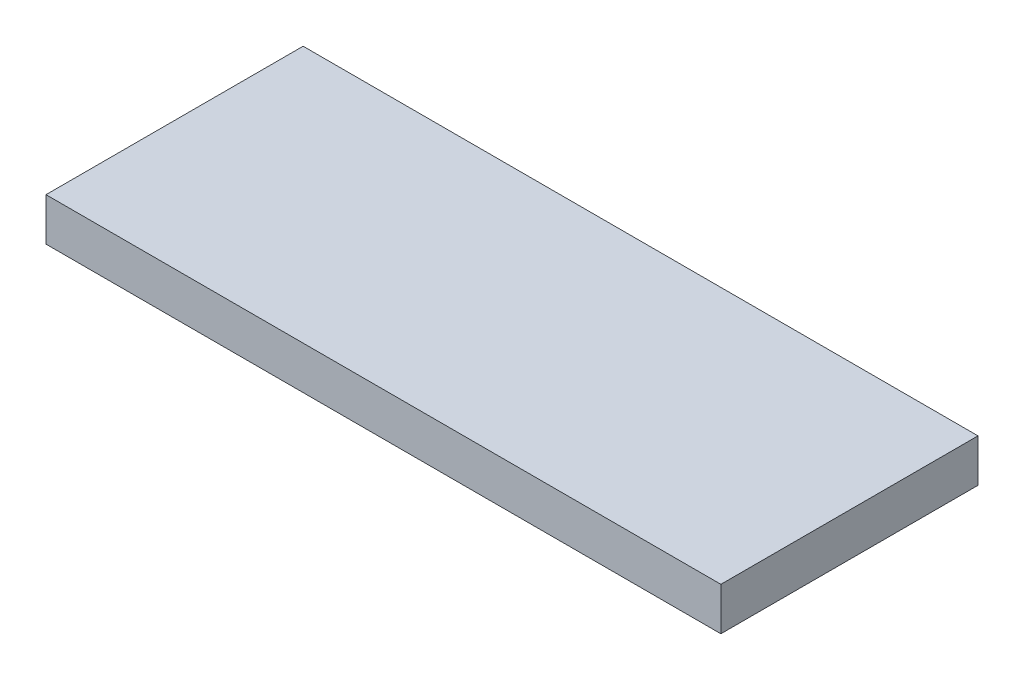
ISO-10303-21;
HEADER;
FILE_DESCRIPTION(('STEP AP214'),'2;1');
FILE_NAME('part.step','',(''),(''),'','','');
FILE_SCHEMA(('AUTOMOTIVE_DESIGN { 1 0 10303 214 1 1 1 1 }'));
ENDSEC;
DATA;
#1=APPLICATION_CONTEXT('core data for automotive mechanical design processes');
#2=APPLICATION_PROTOCOL_DEFINITION('international standard','automotive_design',2000,#1);
#3=PRODUCT_CONTEXT('',#1,'mechanical');
#4=PRODUCT('Part','Part','',(#3));
#5=PRODUCT_RELATED_PRODUCT_CATEGORY('part','',(#4));
#6=PRODUCT_DEFINITION_FORMATION('','',#4);
#7=PRODUCT_DEFINITION_CONTEXT('part definition',#1,'design');
#8=PRODUCT_DEFINITION('design','',#6,#7);
#9=PRODUCT_DEFINITION_SHAPE('','',#8);
#10=(LENGTH_UNIT() NAMED_UNIT(*) SI_UNIT(.MILLI.,.METRE.));
#11=(NAMED_UNIT(*) PLANE_ANGLE_UNIT() SI_UNIT($,.RADIAN.));
#12=(NAMED_UNIT(*) SI_UNIT($,.STERADIAN.) SOLID_ANGLE_UNIT());
#13=UNCERTAINTY_MEASURE_WITH_UNIT(LENGTH_MEASURE(1.E-05),#10,'distance_accuracy_value','');
#14=(GEOMETRIC_REPRESENTATION_CONTEXT(3) GLOBAL_UNCERTAINTY_ASSIGNED_CONTEXT((#13)) GLOBAL_UNIT_ASSIGNED_CONTEXT((#10,
#11,#12)) REPRESENTATION_CONTEXT('',''));
#15=CARTESIAN_POINT('',(0.,0.,0.));
#16=DIRECTION('',(0.,0.,1.));
#17=DIRECTION('',(1.,0.,0.));
#18=AXIS2_PLACEMENT_3D('',#15,#16,#17);
#19=CARTESIAN_POINT('',(0.,6.35,0.));
#20=DIRECTION('',(0.,-1.,0.));
#21=DIRECTION('',(0.,0.,-1.));
#22=AXIS2_PLACEMENT_3D('',#19,#20,#21);
#23=CYLINDRICAL_SURFACE('',#22,2.54);
#24=CARTESIAN_POINT('',(0.,0.,0.));
#25=DIRECTION('',(0.,1.,0.));
#26=DIRECTION('',(0.,0.,1.));
#27=AXIS2_PLACEMENT_3D('',#24,#25,#26);
#28=CIRCLE('',#27,2.54);
#29=CARTESIAN_POINT('',(0.,0.,2.54));
#30=VERTEX_POINT('',#29);
#31=EDGE_CURVE('E110',#30,#30,#28,.T.);
#32=ORIENTED_EDGE('',*,*,#31,.F.);
#33=EDGE_LOOP('',(#32));
#34=FACE_BOUND('',#33,.T.);
#35=CARTESIAN_POINT('',(0.,3.81,0.));
#36=DIRECTION('',(0.,1.,0.));
#37=DIRECTION('',(0.,0.,1.));
#38=AXIS2_PLACEMENT_3D('',#35,#36,#37);
#39=CIRCLE('',#38,2.54);
#40=CARTESIAN_POINT('',(0.,3.81,2.54));
#41=VERTEX_POINT('',#40);
#42=EDGE_CURVE('E125',#41,#41,#39,.T.);
#43=ORIENTED_EDGE('',*,*,#42,.T.);
#44=EDGE_LOOP('',(#43));
#45=FACE_BOUND('',#44,.T.);
#46=ADVANCED_FACE('F43',(#34,#45),#23,.F.);
#47=CARTESIAN_POINT('',(57.48,6.35,0.));
#48=DIRECTION('',(0.,-1.,0.));
#49=DIRECTION('',(0.,0.,-1.));
#50=AXIS2_PLACEMENT_3D('',#47,#48,#49);
#51=CYLINDRICAL_SURFACE('',#50,2.54);
#52=CARTESIAN_POINT('',(57.48,0.,0.));
#53=DIRECTION('',(0.,1.,0.));
#54=DIRECTION('',(0.,0.,1.));
#55=AXIS2_PLACEMENT_3D('',#52,#53,#54);
#56=CIRCLE('',#55,2.54);
#57=CARTESIAN_POINT('',(57.48,0.,2.54));
#58=VERTEX_POINT('',#57);
#59=EDGE_CURVE('E122',#58,#58,#56,.T.);
#60=ORIENTED_EDGE('',*,*,#59,.F.);
#61=EDGE_LOOP('',(#60));
#62=FACE_BOUND('',#61,.T.);
#63=CARTESIAN_POINT('',(57.48,3.81,0.));
#64=DIRECTION('',(0.,1.,0.));
#65=DIRECTION('',(0.,0.,1.));
#66=AXIS2_PLACEMENT_3D('',#63,#64,#65);
#67=CIRCLE('',#66,2.54);
#68=CARTESIAN_POINT('',(57.48,3.81,2.54));
#69=VERTEX_POINT('',#68);
#70=EDGE_CURVE('E47',#69,#69,#67,.T.);
#71=ORIENTED_EDGE('',*,*,#70,.T.);
#72=EDGE_LOOP('',(#71));
#73=FACE_BOUND('',#72,.T.);
#74=ADVANCED_FACE('F132',(#62,#73),#51,.F.);
#75=CARTESIAN_POINT('',(0.,6.35,0.));
#76=DIRECTION('',(0.,-1.,0.));
#77=DIRECTION('',(0.,0.,-1.));
#78=AXIS2_PLACEMENT_3D('',#75,#76,#77);
#79=PLANE('',#78);
#80=DIRECTION('',(0.,0.,-1.));
#81=VECTOR('',#80,1.);
#82=CARTESIAN_POINT('',(78.74,6.35,19.05));
#83=LINE('',#82,#81);
#84=CARTESIAN_POINT('',(78.74,6.35,19.05));
#85=VERTEX_POINT('',#84);
#86=CARTESIAN_POINT('',(78.74,6.35,-19.05));
#87=VERTEX_POINT('',#86);
#88=EDGE_CURVE('E93',#85,#87,#83,.T.);
#89=ORIENTED_EDGE('',*,*,#88,.T.);
#90=DIRECTION('',(-1.,0.,0.));
#91=VECTOR('',#90,1.);
#92=CARTESIAN_POINT('',(-21.26,6.35,-19.05));
#93=LINE('',#92,#91);
#94=CARTESIAN_POINT('',(-21.26,6.35,-19.05));
#95=VERTEX_POINT('',#94);
#96=EDGE_CURVE('E89',#87,#95,#93,.T.);
#97=ORIENTED_EDGE('',*,*,#96,.T.);
#98=DIRECTION('',(0.,0.,1.));
#99=VECTOR('',#98,1.);
#100=CARTESIAN_POINT('',(-21.26,6.35,19.05));
#101=LINE('',#100,#99);
#102=CARTESIAN_POINT('',(-21.26,6.35,19.05));
#103=VERTEX_POINT('',#102);
#104=EDGE_CURVE('E92',#95,#103,#101,.T.);
#105=ORIENTED_EDGE('',*,*,#104,.T.);
#106=DIRECTION('',(1.,0.,0.));
#107=VECTOR('',#106,1.);
#108=CARTESIAN_POINT('',(-21.26,6.35,19.05));
#109=LINE('',#108,#107);
#110=EDGE_CURVE('E61',#103,#85,#109,.T.);
#111=ORIENTED_EDGE('',*,*,#110,.T.);
#112=EDGE_LOOP('',(#89,#97,#105,#111));
#113=FACE_BOUND('',#112,.T.);
#114=ADVANCED_FACE('F90',(#113),#79,.F.);
#115=CARTESIAN_POINT('',(0.,0.,0.));
#116=DIRECTION('',(0.,-1.,0.));
#117=DIRECTION('',(0.,0.,-1.));
#118=AXIS2_PLACEMENT_3D('',#115,#116,#117);
#119=PLANE('',#118);
#120=ORIENTED_EDGE('',*,*,#31,.T.);
#121=EDGE_LOOP('',(#120));
#122=FACE_BOUND('',#121,.T.);
#123=DIRECTION('',(0.,0.,-1.));
#124=VECTOR('',#123,1.);
#125=CARTESIAN_POINT('',(78.74,0.,19.05));
#126=LINE('',#125,#124);
#127=CARTESIAN_POINT('',(78.74,0.,19.05));
#128=VERTEX_POINT('',#127);
#129=CARTESIAN_POINT('',(78.74,0.,-19.05));
#130=VERTEX_POINT('',#129);
#131=EDGE_CURVE('E108',#128,#130,#126,.T.);
#132=ORIENTED_EDGE('',*,*,#131,.F.);
#133=DIRECTION('',(1.,0.,0.));
#134=VECTOR('',#133,1.);
#135=CARTESIAN_POINT('',(-21.26,0.,19.05));
#136=LINE('',#135,#134);
#137=CARTESIAN_POINT('',(-21.26,0.,19.05));
#138=VERTEX_POINT('',#137);
#139=EDGE_CURVE('E114',#138,#128,#136,.T.);
#140=ORIENTED_EDGE('',*,*,#139,.F.);
#141=DIRECTION('',(0.,0.,1.));
#142=VECTOR('',#141,1.);
#143=CARTESIAN_POINT('',(-21.26,0.,19.05));
#144=LINE('',#143,#142);
#145=CARTESIAN_POINT('',(-21.26,0.,-19.05));
#146=VERTEX_POINT('',#145);
#147=EDGE_CURVE('E112',#146,#138,#144,.T.);
#148=ORIENTED_EDGE('',*,*,#147,.F.);
#149=DIRECTION('',(-1.,0.,0.));
#150=VECTOR('',#149,1.);
#151=CARTESIAN_POINT('',(-21.26,0.,-19.05));
#152=LINE('',#151,#150);
#153=EDGE_CURVE('E99',#130,#146,#152,.T.);
#154=ORIENTED_EDGE('',*,*,#153,.F.);
#155=EDGE_LOOP('',(#132,#140,#148,#154));
#156=FACE_BOUND('',#155,.T.);
#157=ORIENTED_EDGE('',*,*,#59,.T.);
#158=EDGE_LOOP('',(#157));
#159=FACE_BOUND('',#158,.T.);
#160=ADVANCED_FACE('F158',(#122,#156,#159),#119,.T.);
#161=CARTESIAN_POINT('',(78.74,6.35,19.05));
#162=DIRECTION('',(-1.,0.,0.));
#163=DIRECTION('',(0.,0.,1.));
#164=AXIS2_PLACEMENT_3D('',#161,#162,#163);
#165=PLANE('',#164);
#166=DIRECTION('',(0.,-1.,0.));
#167=VECTOR('',#166,1.);
#168=CARTESIAN_POINT('',(78.74,6.35,19.05));
#169=LINE('',#168,#167);
#170=EDGE_CURVE('E83',#85,#128,#169,.T.);
#171=ORIENTED_EDGE('',*,*,#170,.T.);
#172=ORIENTED_EDGE('',*,*,#131,.T.);
#173=DIRECTION('',(0.,-1.,0.));
#174=VECTOR('',#173,1.);
#175=CARTESIAN_POINT('',(78.74,6.35,-19.05));
#176=LINE('',#175,#174);
#177=EDGE_CURVE('E11',#87,#130,#176,.T.);
#178=ORIENTED_EDGE('',*,*,#177,.F.);
#179=ORIENTED_EDGE('',*,*,#88,.F.);
#180=EDGE_LOOP('',(#171,#172,#178,#179));
#181=FACE_BOUND('',#180,.T.);
#182=ADVANCED_FACE('F45',(#181),#165,.F.);
#183=CARTESIAN_POINT('',(-21.26,6.35,-19.05));
#184=DIRECTION('',(0.,0.,1.));
#185=DIRECTION('',(1.,0.,0.));
#186=AXIS2_PLACEMENT_3D('',#183,#184,#185);
#187=PLANE('',#186);
#188=ORIENTED_EDGE('',*,*,#177,.T.);
#189=ORIENTED_EDGE('',*,*,#153,.T.);
#190=DIRECTION('',(0.,-1.,0.));
#191=VECTOR('',#190,1.);
#192=CARTESIAN_POINT('',(-21.26,6.35,-19.05));
#193=LINE('',#192,#191);
#194=EDGE_CURVE('E53',#95,#146,#193,.T.);
#195=ORIENTED_EDGE('',*,*,#194,.F.);
#196=ORIENTED_EDGE('',*,*,#96,.F.);
#197=EDGE_LOOP('',(#188,#189,#195,#196));
#198=FACE_BOUND('',#197,.T.);
#199=ADVANCED_FACE('F97',(#198),#187,.F.);
#200=CARTESIAN_POINT('',(-21.26,6.35,19.05));
#201=DIRECTION('',(1.,0.,0.));
#202=DIRECTION('',(0.,0.,-1.));
#203=AXIS2_PLACEMENT_3D('',#200,#201,#202);
#204=PLANE('',#203);
#205=ORIENTED_EDGE('',*,*,#194,.T.);
#206=ORIENTED_EDGE('',*,*,#147,.T.);
#207=DIRECTION('',(0.,-1.,0.));
#208=VECTOR('',#207,1.);
#209=CARTESIAN_POINT('',(-21.26,6.35,19.05));
#210=LINE('',#209,#208);
#211=EDGE_CURVE('E76',#103,#138,#210,.T.);
#212=ORIENTED_EDGE('',*,*,#211,.F.);
#213=ORIENTED_EDGE('',*,*,#104,.F.);
#214=EDGE_LOOP('',(#205,#206,#212,#213));
#215=FACE_BOUND('',#214,.T.);
#216=ADVANCED_FACE('F103',(#215),#204,.F.);
#217=CARTESIAN_POINT('',(-21.26,6.35,19.05));
#218=DIRECTION('',(0.,0.,-1.));
#219=DIRECTION('',(-1.,0.,0.));
#220=AXIS2_PLACEMENT_3D('',#217,#218,#219);
#221=PLANE('',#220);
#222=ORIENTED_EDGE('',*,*,#211,.T.);
#223=ORIENTED_EDGE('',*,*,#139,.T.);
#224=ORIENTED_EDGE('',*,*,#170,.F.);
#225=ORIENTED_EDGE('',*,*,#110,.F.);
#226=EDGE_LOOP('',(#222,#223,#224,#225));
#227=FACE_BOUND('',#226,.T.);
#228=ADVANCED_FACE('F137',(#227),#221,.F.);
#229=CARTESIAN_POINT('',(0.,3.81,0.));
#230=DIRECTION('',(0.,1.,0.));
#231=DIRECTION('',(0.,0.,1.));
#232=AXIS2_PLACEMENT_3D('',#229,#230,#231);
#233=PLANE('',#232);
#234=ORIENTED_EDGE('',*,*,#70,.F.);
#235=EDGE_LOOP('',(#234));
#236=FACE_BOUND('',#235,.T.);
#237=ADVANCED_FACE('F134',(#236),#233,.F.);
#238=ORIENTED_EDGE('',*,*,#42,.F.);
#239=EDGE_LOOP('',(#238));
#240=FACE_BOUND('',#239,.T.);
#241=ADVANCED_FACE('F136',(#240),#233,.F.);
#242=CLOSED_SHELL('',(#46,#74,#114,#160,#182,#199,#216,#228,#237,#241));
#243=MANIFOLD_SOLID_BREP('B2',#242);
#244=ADVANCED_BREP_SHAPE_REPRESENTATION('',(#18,#243),#14);
#245=SHAPE_DEFINITION_REPRESENTATION(#9,#244);
ENDSEC;
END-ISO-10303-21;
